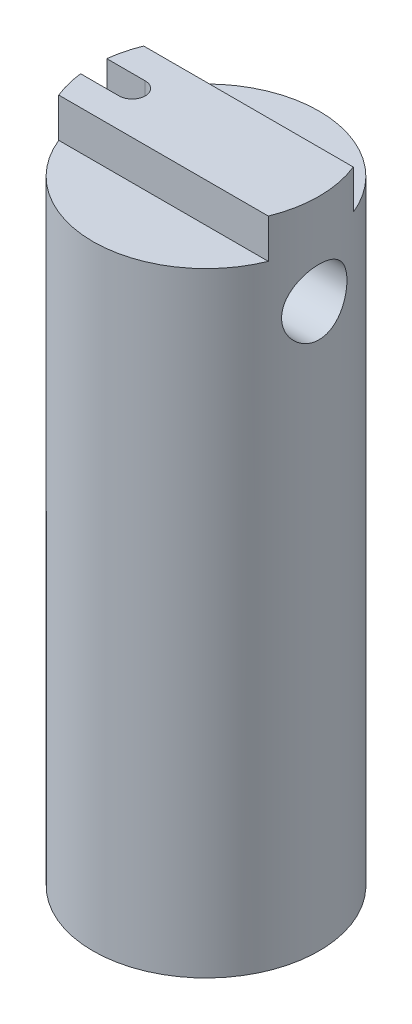
ISO-10303-21;
HEADER;
FILE_DESCRIPTION(('STEP AP214'),'2;1');
FILE_NAME('part.step','',(''),(''),'','','');
FILE_SCHEMA(('AUTOMOTIVE_DESIGN { 1 0 10303 214 1 1 1 1 }'));
ENDSEC;
DATA;
#1=APPLICATION_CONTEXT('core data for automotive mechanical design processes');
#2=APPLICATION_PROTOCOL_DEFINITION('international standard','automotive_design',2000,#1);
#3=PRODUCT_CONTEXT('',#1,'mechanical');
#4=PRODUCT('Part','Part','',(#3));
#5=PRODUCT_RELATED_PRODUCT_CATEGORY('part','',(#4));
#6=PRODUCT_DEFINITION_FORMATION('','',#4);
#7=PRODUCT_DEFINITION_CONTEXT('part definition',#1,'design');
#8=PRODUCT_DEFINITION('design','',#6,#7);
#9=PRODUCT_DEFINITION_SHAPE('','',#8);
#10=(LENGTH_UNIT() NAMED_UNIT(*) SI_UNIT(.MILLI.,.METRE.));
#11=(NAMED_UNIT(*) PLANE_ANGLE_UNIT() SI_UNIT($,.RADIAN.));
#12=(NAMED_UNIT(*) SI_UNIT($,.STERADIAN.) SOLID_ANGLE_UNIT());
#13=UNCERTAINTY_MEASURE_WITH_UNIT(LENGTH_MEASURE(1.E-05),#10,'distance_accuracy_value','');
#14=(GEOMETRIC_REPRESENTATION_CONTEXT(3) GLOBAL_UNCERTAINTY_ASSIGNED_CONTEXT((#13)) GLOBAL_UNIT_ASSIGNED_CONTEXT((#10,
#11,#12)) REPRESENTATION_CONTEXT('',''));
#15=CARTESIAN_POINT('',(0.,0.,0.));
#16=DIRECTION('',(0.,0.,1.));
#17=DIRECTION('',(1.,0.,0.));
#18=AXIS2_PLACEMENT_3D('',#15,#16,#17);
#19=CARTESIAN_POINT('',(0.,-50.,0.));
#20=DIRECTION('',(0.,1.,0.));
#21=DIRECTION('',(0.,0.,1.));
#22=AXIS2_PLACEMENT_3D('',#19,#20,#21);
#23=CYLINDRICAL_SURFACE('',#22,8.65000000000001);
#24=CARTESIAN_POINT('',(8.28085140550174,-7.,-2.49999999999999));
#25=CARTESIAN_POINT('',(8.28085322376039,-6.86275889358771,-2.49999769228479));
#26=CARTESIAN_POINT('',(8.28430054332778,-6.72549461628499,-2.48866045927901));
#27=CARTESIAN_POINT('',(8.2976670899937,-6.45496245214444,-2.44371720208671));
#28=CARTESIAN_POINT('',(8.30758884133336,-6.32169614523445,-2.41010249231336));
#29=CARTESIAN_POINT('',(8.33268872764418,-6.06311422261727,-2.32182760939016));
#30=CARTESIAN_POINT('',(8.34785858328595,-5.93778644946403,-2.26720056987894));
#31=CARTESIAN_POINT('',(8.38173444287658,-5.69804713837223,-2.13855897619452));
#32=CARTESIAN_POINT('',(8.40044089191065,-5.58363697716041,-2.06454198131571));
#33=CARTESIAN_POINT('',(8.43989824325808,-5.36562032598627,-1.89689487117158));
#34=CARTESIAN_POINT('',(8.46069027844958,-5.26238194617315,-1.80279562216665));
#35=CARTESIAN_POINT('',(8.50162347229231,-5.07290963685424,-1.59866174479604));
#36=CARTESIAN_POINT('',(8.52176455283785,-4.98667774160831,-1.48862521279191));
#37=CARTESIAN_POINT('',(8.55959091954456,-4.83208950058936,-1.25314418411789));
#38=CARTESIAN_POINT('',(8.57722206612258,-4.76410528932715,-1.12744593317654));
#39=CARTESIAN_POINT('',(8.60756615481593,-4.65037988823474,-0.865806137571206));
#40=CARTESIAN_POINT('',(8.62028007768423,-4.60463426239299,-0.729866642019158));
#41=CARTESIAN_POINT('',(8.63906623394997,-4.53789359716114,-0.455451452356293));
#42=CARTESIAN_POINT('',(8.64530657227224,-4.5162709443423,-0.317140114448814));
#43=CARTESIAN_POINT('',(8.65103299621578,-4.49640888690367,-0.0387215687059775));
#44=CARTESIAN_POINT('',(8.65052040187899,-4.49816491229442,0.101385282798723));
#45=CARTESIAN_POINT('',(8.6429190331002,-4.52458200293445,0.375026599869924));
#46=CARTESIAN_POINT('',(8.6360252374013,-4.54856397684487,0.508632884649997));
#47=CARTESIAN_POINT('',(8.61667065260533,-4.61764708793833,0.769836720116405));
#48=CARTESIAN_POINT('',(8.60420952141952,-4.6627495228908,0.897433901036584));
#49=CARTESIAN_POINT('',(8.57484418518508,-4.7732734448961,1.14465227980842));
#50=CARTESIAN_POINT('',(8.55789218916658,-4.83891495431073,1.26416920176256));
#51=CARTESIAN_POINT('',(8.52135310844036,-4.98848155042203,1.49071374952026));
#52=CARTESIAN_POINT('',(8.50176543559973,-5.07241072047892,1.5977385778176));
#53=CARTESIAN_POINT('',(8.46123095697068,-5.25972125834663,1.80031492214499));
#54=CARTESIAN_POINT('',(8.44026060223056,-5.36369254293566,1.89531696591399));
#55=CARTESIAN_POINT('',(8.39994547788299,-5.58630076609,2.066684950439));
#56=CARTESIAN_POINT('',(8.3806008467113,-5.70493895146947,2.14304930518591));
#57=CARTESIAN_POINT('',(8.34562064374236,-5.95487175612977,2.27549291299663));
#58=CARTESIAN_POINT('',(8.33001733288379,-6.08626363006372,2.33139777376546));
#59=CARTESIAN_POINT('',(8.3046741970681,-6.3571496169274,2.42013226280127));
#60=CARTESIAN_POINT('',(8.29493261974098,-6.49664129472688,2.45296878785813));
#61=CARTESIAN_POINT('',(8.28279676206013,-6.77456817162309,2.49363498431357));
#62=CARTESIAN_POINT('',(8.28015874382514,-6.91287140149247,2.50229461475222));
#63=CARTESIAN_POINT('',(8.2818570952544,-7.18895519418841,2.49666841228663));
#64=CARTESIAN_POINT('',(8.28619257120024,-7.32673582172305,2.4823855196813));
#65=CARTESIAN_POINT('',(8.30111144335729,-7.59449342913186,2.43201645868713));
#66=CARTESIAN_POINT('',(8.31154507352058,-7.72457781669547,2.39645245580023));
#67=CARTESIAN_POINT('',(8.33733248636691,-7.97692857106371,2.30512983258329));
#68=CARTESIAN_POINT('',(8.35268699053245,-8.09919378829191,2.2493682507939));
#69=CARTESIAN_POINT('',(8.3870680997782,-8.33584418852758,2.11762173240531));
#70=CARTESIAN_POINT('',(8.40617756772015,-8.44995277988932,2.04116211759291));
#71=CARTESIAN_POINT('',(8.4457318258527,-8.66402381235529,1.87076193412246));
#72=CARTESIAN_POINT('',(8.46617691167614,-8.76398310596633,1.77681748671075));
#73=CARTESIAN_POINT('',(8.50695656464454,-8.95048464614675,1.57023366032182));
#74=CARTESIAN_POINT('',(8.52726273302557,-9.03644167951082,1.45705911465026));
#75=CARTESIAN_POINT('',(8.56475831258217,-9.1881510131364,1.2174158958495));
#76=CARTESIAN_POINT('',(8.58194788525379,-9.25390436043724,1.09094791209778));
#77=CARTESIAN_POINT('',(8.61116483842541,-9.36270966992412,0.829176090527664));
#78=CARTESIAN_POINT('',(8.62323110853566,-9.40593324239973,0.693948139322728));
#79=CARTESIAN_POINT('',(8.64101371064214,-9.46891538769943,0.417740144326336));
#80=CARTESIAN_POINT('',(8.64673171743505,-9.48868014951411,0.276761627827327));
#81=CARTESIAN_POINT('',(8.65107930152753,-9.50374075806176,-0.00151823492443659));
#82=CARTESIAN_POINT('',(8.64995564337549,-9.49988839002659,-0.138770225457254));
#83=CARTESIAN_POINT('',(8.64131972256357,-9.4698403531093,-0.41058960183081));
#84=CARTESIAN_POINT('',(8.63380777832634,-9.4436457978682,-0.54515712113625));
#85=CARTESIAN_POINT('',(8.61330271008766,-9.37016979152791,-0.806575458170936));
#86=CARTESIAN_POINT('',(8.60036140915817,-9.32308747559144,-0.933486586325141));
#87=CARTESIAN_POINT('',(8.57034000082596,-9.20934971696781,-1.17767733386419));
#88=CARTESIAN_POINT('',(8.55325924315235,-9.14269119868902,-1.29495543610907));
#89=CARTESIAN_POINT('',(8.5161214057924,-8.98934945085336,-1.52040539398673));
#90=CARTESIAN_POINT('',(8.49598989406107,-8.90212123783287,-1.62819423311826));
#91=CARTESIAN_POINT('',(8.45527783091918,-8.71111518887002,-1.82789062235672));
#92=CARTESIAN_POINT('',(8.43469715566095,-8.60733273737311,-1.91979372836344));
#93=CARTESIAN_POINT('',(8.39476598761253,-8.38279055628811,-2.08759650932855));
#94=CARTESIAN_POINT('',(8.37546385378877,-8.26164741480997,-2.16299583453981));
#95=CARTESIAN_POINT('',(8.34101541303892,-8.00786333984392,-2.29226184120731));
#96=CARTESIAN_POINT('',(8.32586685481773,-7.87522868642315,-2.34614019458919));
#97=CARTESIAN_POINT('',(8.30314969949933,-7.61959099223756,-2.42521604453701));
#98=CARTESIAN_POINT('',(8.29486282049023,-7.49750372993507,-2.4531868369833));
#99=CARTESIAN_POINT('',(8.28371329696176,-7.25028372678931,-2.49057831939011));
#100=CARTESIAN_POINT('',(8.28084974741402,-7.12515149761131,-2.5000021044279));
#101=CARTESIAN_POINT('',(8.28085140550174,-7.,-2.49999999999999));
#102=B_SPLINE_CURVE_WITH_KNOTS('',3,(#24,#25,#26,#27,#28,#29,#30,#31,#32,#33,#34,#35,#36,#37,
#38,#39,#40,#41,#42,#43,#44,#45,#46,#47,#48,#49,#50,#51,#52,#53,#54,#55,#56,#57,#58,#59,#60,#61,
#62,#63,#64,#65,#66,#67,#68,#69,#70,#71,#72,#73,#74,#75,#76,#77,#78,#79,#80,#81,#82,#83,#84,#85,
#86,#87,#88,#89,#90,#91,#92,#93,#94,#95,#96,#97,#98,#99,#100,#101),.UNSPECIFIED.,.T.,.F.,(4,2,2,
2,2,2,2,2,2,2,2,2,2,2,2,2,2,2,2,2,2,2,2,2,2,2,2,2,2,2,2,2,2,2,2,2,2,2,4),(0.,0.411262171979639,
0.822684782074835,1.23346127574435,1.6442895006641,2.06604041547225,2.48784174818307,
2.9176846054889,3.34744168525811,3.76573611038611,4.18394876985462,4.58979026664504,
4.99565670407505,5.4060290563878,5.81649313275795,6.24168527722219,6.66691359160376,
7.0956863964371,7.52433095552636,7.93806836379586,8.35175275197718,8.75568057143647,
9.15966764058979,9.57384586871271,9.98811608594928,10.4167468573414,10.8453554115503,
11.2706496844102,11.6958317295967,12.1057714274345,12.5156906931192,12.9217832420427,
13.3279396257996,13.7463881494923,14.1649535471111,14.5948453531576,15.0245036892449,
15.3996002578841,15.7746342260562),.UNSPECIFIED.);
#103=CARTESIAN_POINT('',(8.28085140550174,-7.,-2.49999999999999));
#104=VERTEX_POINT('',#103);
#105=EDGE_CURVE('E13',#104,#104,#102,.T.);
#106=ORIENTED_EDGE('',*,*,#105,.F.);
#107=EDGE_LOOP('',(#106));
#108=FACE_BOUND('',#107,.T.);
#109=DIRECTION('',(0.,1.,0.));
#110=VECTOR('',#109,1.);
#111=CARTESIAN_POINT('',(-8.01623352953244,-50.,3.25));
#112=LINE('',#111,#110);
#113=CARTESIAN_POINT('',(-8.01623352953244,0.,3.25));
#114=VERTEX_POINT('',#113);
#115=CARTESIAN_POINT('',(-8.01623352953244,-3.,3.25));
#116=VERTEX_POINT('',#115);
#117=EDGE_CURVE('E167',#114,#116,#112,.F.);
#118=ORIENTED_EDGE('',*,*,#117,.F.);
#119=CARTESIAN_POINT('',(0.,0.,0.));
#120=DIRECTION('',(0.,1.,0.));
#121=DIRECTION('',(0.,0.,1.));
#122=AXIS2_PLACEMENT_3D('',#119,#120,#121);
#123=CIRCLE('',#122,8.65000000000001);
#124=CARTESIAN_POINT('',(-8.59200209497182,0.,1.));
#125=VERTEX_POINT('',#124);
#126=EDGE_CURVE('E216',#125,#114,#123,.T.);
#127=ORIENTED_EDGE('',*,*,#126,.F.);
#128=DIRECTION('',(0.,1.,0.));
#129=VECTOR('',#128,1.);
#130=CARTESIAN_POINT('',(-8.59200209497182,-50.,1.));
#131=LINE('',#130,#129);
#132=CARTESIAN_POINT('',(-8.59200209497182,-10.,1.));
#133=VERTEX_POINT('',#132);
#134=EDGE_CURVE('E185',#125,#133,#131,.F.);
#135=ORIENTED_EDGE('',*,*,#134,.T.);
#136=CARTESIAN_POINT('',(0.,-10.,0.));
#137=DIRECTION('',(0.,-1.,0.));
#138=DIRECTION('',(0.,0.,-1.));
#139=AXIS2_PLACEMENT_3D('',#136,#137,#138);
#140=CIRCLE('',#139,8.65000000000001);
#141=CARTESIAN_POINT('',(-8.11310667993464,-10.,3.));
#142=VERTEX_POINT('',#141);
#143=EDGE_CURVE('E222',#133,#142,#140,.F.);
#144=ORIENTED_EDGE('',*,*,#143,.T.);
#145=DIRECTION('',(0.,1.,0.));
#146=VECTOR('',#145,1.);
#147=CARTESIAN_POINT('',(-8.11310667993464,-50.,3.));
#148=LINE('',#147,#146);
#149=CARTESIAN_POINT('',(-8.11310667993464,-50.,3.));
#150=VERTEX_POINT('',#149);
#151=EDGE_CURVE('E204',#150,#142,#148,.T.);
#152=ORIENTED_EDGE('',*,*,#151,.F.);
#153=CARTESIAN_POINT('',(0.,-50.,0.));
#154=DIRECTION('',(0.,1.,0.));
#155=DIRECTION('',(0.,0.,1.));
#156=AXIS2_PLACEMENT_3D('',#153,#154,#155);
#157=CIRCLE('',#156,8.65000000000001);
#158=CARTESIAN_POINT('',(-8.11310667993464,-50.,-3.));
#159=VERTEX_POINT('',#158);
#160=EDGE_CURVE('E212',#150,#159,#157,.T.);
#161=ORIENTED_EDGE('',*,*,#160,.T.);
#162=DIRECTION('',(0.,1.,0.));
#163=VECTOR('',#162,1.);
#164=CARTESIAN_POINT('',(-8.11310667993464,-50.,-3.));
#165=LINE('',#164,#163);
#166=CARTESIAN_POINT('',(-8.11310667993464,-10.,-3.));
#167=VERTEX_POINT('',#166);
#168=EDGE_CURVE('E209',#167,#159,#165,.F.);
#169=ORIENTED_EDGE('',*,*,#168,.F.);
#170=CARTESIAN_POINT('',(-8.59200209497182,-10.,-1.));
#171=VERTEX_POINT('',#170);
#172=EDGE_CURVE('E223',#167,#171,#140,.F.);
#173=ORIENTED_EDGE('',*,*,#172,.T.);
#174=DIRECTION('',(0.,1.,0.));
#175=VECTOR('',#174,1.);
#176=CARTESIAN_POINT('',(-8.59200209497182,-50.,-1.));
#177=LINE('',#176,#175);
#178=CARTESIAN_POINT('',(-8.59200209497182,0.,-1.));
#179=VERTEX_POINT('',#178);
#180=EDGE_CURVE('E182',#171,#179,#177,.T.);
#181=ORIENTED_EDGE('',*,*,#180,.T.);
#182=CARTESIAN_POINT('',(-8.01623352953244,0.,-3.25));
#183=VERTEX_POINT('',#182);
#184=EDGE_CURVE('E211',#183,#179,#123,.T.);
#185=ORIENTED_EDGE('',*,*,#184,.F.);
#186=DIRECTION('',(0.,1.,0.));
#187=VECTOR('',#186,1.);
#188=CARTESIAN_POINT('',(-8.0162335295323,-50.,-3.25000000000035));
#189=LINE('',#188,#187);
#190=CARTESIAN_POINT('',(-8.0162335295323,-3.,-3.25000000000002));
#191=VERTEX_POINT('',#190);
#192=EDGE_CURVE('E69',#191,#183,#189,.T.);
#193=ORIENTED_EDGE('',*,*,#192,.F.);
#194=CARTESIAN_POINT('',(0.,-3.,0.));
#195=DIRECTION('',(0.,-1.,0.));
#196=DIRECTION('',(0.,0.,-1.));
#197=AXIS2_PLACEMENT_3D('',#194,#195,#196);
#198=CIRCLE('',#197,8.65000000000001);
#199=CARTESIAN_POINT('',(8.0162335295323,-3.,-3.25000000000002));
#200=VERTEX_POINT('',#199);
#201=EDGE_CURVE('E239',#200,#191,#198,.F.);
#202=ORIENTED_EDGE('',*,*,#201,.F.);
#203=DIRECTION('',(0.,1.,0.));
#204=VECTOR('',#203,1.);
#205=CARTESIAN_POINT('',(8.0162335295323,-50.,-3.25000000000035));
#206=LINE('',#205,#204);
#207=CARTESIAN_POINT('',(8.01623352953244,0.,-3.25));
#208=VERTEX_POINT('',#207);
#209=EDGE_CURVE('E164',#208,#200,#206,.F.);
#210=ORIENTED_EDGE('',*,*,#209,.F.);
#211=CARTESIAN_POINT('',(8.01623352953244,0.,3.25));
#212=VERTEX_POINT('',#211);
#213=EDGE_CURVE('E219',#212,#208,#123,.T.);
#214=ORIENTED_EDGE('',*,*,#213,.F.);
#215=DIRECTION('',(0.,1.,0.));
#216=VECTOR('',#215,1.);
#217=CARTESIAN_POINT('',(8.01623352953244,-50.,3.25));
#218=LINE('',#217,#216);
#219=CARTESIAN_POINT('',(8.01623352953244,-3.,3.25));
#220=VERTEX_POINT('',#219);
#221=EDGE_CURVE('E77',#220,#212,#218,.T.);
#222=ORIENTED_EDGE('',*,*,#221,.F.);
#223=CARTESIAN_POINT('',(0.,-3.,0.));
#224=DIRECTION('',(0.,-1.,0.));
#225=DIRECTION('',(0.,0.,-1.));
#226=AXIS2_PLACEMENT_3D('',#223,#224,#225);
#227=CIRCLE('',#226,8.65000000000001);
#228=EDGE_CURVE('E62',#116,#220,#227,.F.);
#229=ORIENTED_EDGE('',*,*,#228,.F.);
#230=EDGE_LOOP('',(#118,#127,#135,#144,#152,#161,#169,#173,#181,#185,#193,#202,#210,#214,#222,#229));
#231=FACE_BOUND('',#230,.T.);
#232=ADVANCED_FACE('F50',(#108,#231),#23,.T.);
#233=CARTESIAN_POINT('',(0.,0.,0.));
#234=DIRECTION('',(0.,1.,0.));
#235=DIRECTION('',(0.,0.,1.));
#236=AXIS2_PLACEMENT_3D('',#233,#234,#235);
#237=PLANE('',#236);
#238=DIRECTION('',(-1.,0.,0.));
#239=VECTOR('',#238,1.);
#240=CARTESIAN_POINT('',(0.,0.,3.25));
#241=LINE('',#240,#239);
#242=EDGE_CURVE('E237',#212,#114,#241,.T.);
#243=ORIENTED_EDGE('',*,*,#242,.F.);
#244=ORIENTED_EDGE('',*,*,#213,.T.);
#245=DIRECTION('',(1.,0.,0.));
#246=VECTOR('',#245,1.);
#247=CARTESIAN_POINT('',(0.,0.,-3.25));
#248=LINE('',#247,#246);
#249=EDGE_CURVE('E235',#183,#208,#248,.T.);
#250=ORIENTED_EDGE('',*,*,#249,.F.);
#251=ORIENTED_EDGE('',*,*,#184,.T.);
#252=DIRECTION('',(1.,0.,0.));
#253=VECTOR('',#252,1.);
#254=CARTESIAN_POINT('',(-5.65,0.,-1.));
#255=LINE('',#254,#253);
#256=CARTESIAN_POINT('',(-5.65,0.,-1.));
#257=VERTEX_POINT('',#256);
#258=EDGE_CURVE('E175',#179,#257,#255,.T.);
#259=ORIENTED_EDGE('',*,*,#258,.T.);
#260=CARTESIAN_POINT('',(-5.65,0.,0.));
#261=DIRECTION('',(0.,-1.,0.));
#262=DIRECTION('',(0.,0.,-1.));
#263=AXIS2_PLACEMENT_3D('',#260,#261,#262);
#264=CIRCLE('',#263,1.);
#265=CARTESIAN_POINT('',(-5.65,0.,1.));
#266=VERTEX_POINT('',#265);
#267=EDGE_CURVE('E169',#257,#266,#264,.T.);
#268=ORIENTED_EDGE('',*,*,#267,.T.);
#269=DIRECTION('',(-1.,0.,0.));
#270=VECTOR('',#269,1.);
#271=CARTESIAN_POINT('',(-5.65,0.,1.));
#272=LINE('',#271,#270);
#273=EDGE_CURVE('E172',#266,#125,#272,.T.);
#274=ORIENTED_EDGE('',*,*,#273,.T.);
#275=ORIENTED_EDGE('',*,*,#126,.T.);
#276=EDGE_LOOP('',(#243,#244,#250,#251,#259,#268,#274,#275));
#277=FACE_BOUND('',#276,.T.);
#278=ADVANCED_FACE('F253',(#277),#237,.T.);
#279=CARTESIAN_POINT('',(-5.65,-10.,0.));
#280=DIRECTION('',(0.,-1.,0.));
#281=DIRECTION('',(0.,0.,-1.));
#282=AXIS2_PLACEMENT_3D('',#279,#280,#281);
#283=PLANE('',#282);
#284=ORIENTED_EDGE('',*,*,#143,.F.);
#285=DIRECTION('',(1.,0.,0.));
#286=VECTOR('',#285,1.);
#287=CARTESIAN_POINT('',(-5.65,-10.,1.));
#288=LINE('',#287,#286);
#289=CARTESIAN_POINT('',(-5.65,-10.,1.));
#290=VERTEX_POINT('',#289);
#291=EDGE_CURVE('E232',#133,#290,#288,.T.);
#292=ORIENTED_EDGE('',*,*,#291,.T.);
#293=CARTESIAN_POINT('',(-5.65,-10.,0.));
#294=DIRECTION('',(0.,-1.,0.));
#295=DIRECTION('',(0.,0.,-1.));
#296=AXIS2_PLACEMENT_3D('',#293,#294,#295);
#297=CIRCLE('',#296,1.);
#298=CARTESIAN_POINT('',(-5.65,-10.,-1.));
#299=VERTEX_POINT('',#298);
#300=EDGE_CURVE('E229',#290,#299,#297,.F.);
#301=ORIENTED_EDGE('',*,*,#300,.T.);
#302=DIRECTION('',(-1.,0.,0.));
#303=VECTOR('',#302,1.);
#304=CARTESIAN_POINT('',(-5.65,-10.,-1.));
#305=LINE('',#304,#303);
#306=EDGE_CURVE('E226',#299,#171,#305,.T.);
#307=ORIENTED_EDGE('',*,*,#306,.T.);
#308=ORIENTED_EDGE('',*,*,#172,.F.);
#309=DIRECTION('',(1.,0.,0.));
#310=VECTOR('',#309,1.);
#311=CARTESIAN_POINT('',(-5.65,-10.,-3.));
#312=LINE('',#311,#310);
#313=CARTESIAN_POINT('',(-5.65,-10.,-3.));
#314=VERTEX_POINT('',#313);
#315=EDGE_CURVE('E196',#167,#314,#312,.T.);
#316=ORIENTED_EDGE('',*,*,#315,.T.);
#317=CARTESIAN_POINT('',(-5.65,-10.,0.));
#318=DIRECTION('',(0.,-1.,0.));
#319=DIRECTION('',(0.,0.,-1.));
#320=AXIS2_PLACEMENT_3D('',#317,#318,#319);
#321=CIRCLE('',#320,3.);
#322=CARTESIAN_POINT('',(-5.65000000000001,-10.,3.));
#323=VERTEX_POINT('',#322);
#324=EDGE_CURVE('E189',#314,#323,#321,.T.);
#325=ORIENTED_EDGE('',*,*,#324,.T.);
#326=DIRECTION('',(-1.,0.,0.));
#327=VECTOR('',#326,1.);
#328=CARTESIAN_POINT('',(-5.65000000000001,-10.,3.));
#329=LINE('',#328,#327);
#330=EDGE_CURVE('E192',#323,#142,#329,.T.);
#331=ORIENTED_EDGE('',*,*,#330,.T.);
#332=EDGE_LOOP('',(#284,#292,#301,#307,#308,#316,#325,#331));
#333=FACE_BOUND('',#332,.T.);
#334=ADVANCED_FACE('F262',(#333),#283,.T.);
#335=CARTESIAN_POINT('',(0.,-50.,0.));
#336=DIRECTION('',(0.,1.,0.));
#337=DIRECTION('',(0.,0.,1.));
#338=AXIS2_PLACEMENT_3D('',#335,#336,#337);
#339=PLANE('',#338);
#340=CARTESIAN_POINT('',(-5.65,-50.,0.));
#341=DIRECTION('',(0.,-1.,0.));
#342=DIRECTION('',(0.,0.,-1.));
#343=AXIS2_PLACEMENT_3D('',#340,#341,#342);
#344=CIRCLE('',#343,3.);
#345=CARTESIAN_POINT('',(-5.65,-50.,-3.));
#346=VERTEX_POINT('',#345);
#347=CARTESIAN_POINT('',(-5.65000000000001,-50.,3.));
#348=VERTEX_POINT('',#347);
#349=EDGE_CURVE('E188',#346,#348,#344,.T.);
#350=ORIENTED_EDGE('',*,*,#349,.F.);
#351=DIRECTION('',(-1.,0.,0.));
#352=VECTOR('',#351,1.);
#353=CARTESIAN_POINT('',(0.,-50.,-3.));
#354=LINE('',#353,#352);
#355=EDGE_CURVE('E215',#346,#159,#354,.T.);
#356=ORIENTED_EDGE('',*,*,#355,.T.);
#357=ORIENTED_EDGE('',*,*,#160,.F.);
#358=DIRECTION('',(-1.,0.,0.));
#359=VECTOR('',#358,1.);
#360=CARTESIAN_POINT('',(-5.65000000000001,-50.,3.));
#361=LINE('',#360,#359);
#362=EDGE_CURVE('E193',#348,#150,#361,.T.);
#363=ORIENTED_EDGE('',*,*,#362,.F.);
#364=EDGE_LOOP('',(#350,#356,#357,#363));
#365=FACE_BOUND('',#364,.T.);
#366=ADVANCED_FACE('F277',(#365),#339,.F.);
#367=CARTESIAN_POINT('',(-5.65,-10.,0.));
#368=DIRECTION('',(0.,-1.,0.));
#369=DIRECTION('',(0.,0.,-1.));
#370=AXIS2_PLACEMENT_3D('',#367,#368,#369);
#371=CYLINDRICAL_SURFACE('',#370,3.);
#372=ORIENTED_EDGE('',*,*,#349,.T.);
#373=DIRECTION('',(0.,-1.,0.));
#374=VECTOR('',#373,1.);
#375=CARTESIAN_POINT('',(-5.65000000000001,-10.,3.));
#376=LINE('',#375,#374);
#377=EDGE_CURVE('E198',#323,#348,#376,.T.);
#378=ORIENTED_EDGE('',*,*,#377,.F.);
#379=ORIENTED_EDGE('',*,*,#324,.F.);
#380=DIRECTION('',(0.,-1.,0.));
#381=VECTOR('',#380,1.);
#382=CARTESIAN_POINT('',(-5.65,-10.,-3.));
#383=LINE('',#382,#381);
#384=EDGE_CURVE('E201',#314,#346,#383,.T.);
#385=ORIENTED_EDGE('',*,*,#384,.T.);
#386=EDGE_LOOP('',(#372,#378,#379,#385));
#387=FACE_BOUND('',#386,.T.);
#388=ADVANCED_FACE('F269',(#387),#371,.F.);
#389=CARTESIAN_POINT('',(-5.65,-10.,-3.));
#390=DIRECTION('',(0.,0.,-1.));
#391=DIRECTION('',(-1.,0.,0.));
#392=AXIS2_PLACEMENT_3D('',#389,#390,#391);
#393=PLANE('',#392);
#394=ORIENTED_EDGE('',*,*,#168,.T.);
#395=ORIENTED_EDGE('',*,*,#355,.F.);
#396=ORIENTED_EDGE('',*,*,#384,.F.);
#397=ORIENTED_EDGE('',*,*,#315,.F.);
#398=EDGE_LOOP('',(#394,#395,#396,#397));
#399=FACE_BOUND('',#398,.T.);
#400=ADVANCED_FACE('F265',(#399),#393,.F.);
#401=CARTESIAN_POINT('',(-5.65000000000001,-10.,3.));
#402=DIRECTION('',(0.,0.,1.));
#403=DIRECTION('',(1.,0.,0.));
#404=AXIS2_PLACEMENT_3D('',#401,#402,#403);
#405=PLANE('',#404);
#406=ORIENTED_EDGE('',*,*,#151,.T.);
#407=ORIENTED_EDGE('',*,*,#330,.F.);
#408=ORIENTED_EDGE('',*,*,#377,.T.);
#409=ORIENTED_EDGE('',*,*,#362,.T.);
#410=EDGE_LOOP('',(#406,#407,#408,#409));
#411=FACE_BOUND('',#410,.T.);
#412=ADVANCED_FACE('F272',(#411),#405,.F.);
#413=CARTESIAN_POINT('',(-5.65,-50.,0.));
#414=DIRECTION('',(0.,1.,0.));
#415=DIRECTION('',(0.,0.,1.));
#416=AXIS2_PLACEMENT_3D('',#413,#414,#415);
#417=CYLINDRICAL_SURFACE('',#416,1.);
#418=DIRECTION('',(0.,1.,0.));
#419=VECTOR('',#418,1.);
#420=CARTESIAN_POINT('',(-5.65,-50.,1.));
#421=LINE('',#420,#419);
#422=EDGE_CURVE('E180',#290,#266,#421,.T.);
#423=ORIENTED_EDGE('',*,*,#422,.T.);
#424=ORIENTED_EDGE('',*,*,#267,.F.);
#425=DIRECTION('',(0.,1.,0.));
#426=VECTOR('',#425,1.);
#427=CARTESIAN_POINT('',(-5.65,-50.,-1.));
#428=LINE('',#427,#426);
#429=EDGE_CURVE('E178',#299,#257,#428,.T.);
#430=ORIENTED_EDGE('',*,*,#429,.F.);
#431=ORIENTED_EDGE('',*,*,#300,.F.);
#432=EDGE_LOOP('',(#423,#424,#430,#431));
#433=FACE_BOUND('',#432,.T.);
#434=ADVANCED_FACE('F314',(#433),#417,.F.);
#435=CARTESIAN_POINT('',(-5.65,-50.,1.));
#436=DIRECTION('',(0.,0.,-1.));
#437=DIRECTION('',(-1.,0.,0.));
#438=AXIS2_PLACEMENT_3D('',#435,#436,#437);
#439=PLANE('',#438);
#440=ORIENTED_EDGE('',*,*,#273,.F.);
#441=ORIENTED_EDGE('',*,*,#422,.F.);
#442=ORIENTED_EDGE('',*,*,#291,.F.);
#443=ORIENTED_EDGE('',*,*,#134,.F.);
#444=EDGE_LOOP('',(#440,#441,#442,#443));
#445=FACE_BOUND('',#444,.T.);
#446=ADVANCED_FACE('F311',(#445),#439,.T.);
#447=CARTESIAN_POINT('',(-5.65,-50.,-1.));
#448=DIRECTION('',(0.,0.,1.));
#449=DIRECTION('',(1.,0.,0.));
#450=AXIS2_PLACEMENT_3D('',#447,#448,#449);
#451=PLANE('',#450);
#452=ORIENTED_EDGE('',*,*,#306,.F.);
#453=ORIENTED_EDGE('',*,*,#429,.T.);
#454=ORIENTED_EDGE('',*,*,#258,.F.);
#455=ORIENTED_EDGE('',*,*,#180,.F.);
#456=EDGE_LOOP('',(#452,#453,#454,#455));
#457=FACE_BOUND('',#456,.T.);
#458=ADVANCED_FACE('F255',(#457),#451,.T.);
#459=CARTESIAN_POINT('',(-8.59200209497182,-3.,-3.25000000000002));
#460=DIRECTION('',(0.,-1.,0.));
#461=DIRECTION('',(0.,0.,-1.));
#462=AXIS2_PLACEMENT_3D('',#459,#460,#461);
#463=PLANE('',#462);
#464=ORIENTED_EDGE('',*,*,#201,.T.);
#465=DIRECTION('',(1.,0.,0.));
#466=VECTOR('',#465,1.);
#467=CARTESIAN_POINT('',(-8.59200209497182,-3.,-3.25000000000002));
#468=LINE('',#467,#466);
#469=EDGE_CURVE('E156',#191,#200,#468,.T.);
#470=ORIENTED_EDGE('',*,*,#469,.T.);
#471=EDGE_LOOP('',(#464,#470));
#472=FACE_BOUND('',#471,.T.);
#473=ADVANCED_FACE('F305',(#472),#463,.F.);
#474=CARTESIAN_POINT('',(-8.59200209497182,-3.,-3.25000000000002));
#475=DIRECTION('',(0.,0.,1.));
#476=DIRECTION('',(0.,-1.,0.));
#477=AXIS2_PLACEMENT_3D('',#474,#475,#476);
#478=PLANE('',#477);
#479=ORIENTED_EDGE('',*,*,#209,.T.);
#480=ORIENTED_EDGE('',*,*,#469,.F.);
#481=ORIENTED_EDGE('',*,*,#192,.T.);
#482=ORIENTED_EDGE('',*,*,#249,.T.);
#483=EDGE_LOOP('',(#479,#480,#481,#482));
#484=FACE_BOUND('',#483,.T.);
#485=ADVANCED_FACE('F302',(#484),#478,.F.);
#486=CARTESIAN_POINT('',(-8.59200209497182,-3.,3.25));
#487=DIRECTION('',(0.,0.,-1.));
#488=DIRECTION('',(-1.,0.,0.));
#489=AXIS2_PLACEMENT_3D('',#486,#487,#488);
#490=PLANE('',#489);
#491=ORIENTED_EDGE('',*,*,#117,.T.);
#492=DIRECTION('',(1.,0.,0.));
#493=VECTOR('',#492,1.);
#494=CARTESIAN_POINT('',(-8.59200209497182,-3.,3.25));
#495=LINE('',#494,#493);
#496=EDGE_CURVE('E159',#116,#220,#495,.T.);
#497=ORIENTED_EDGE('',*,*,#496,.T.);
#498=ORIENTED_EDGE('',*,*,#221,.T.);
#499=ORIENTED_EDGE('',*,*,#242,.T.);
#500=EDGE_LOOP('',(#491,#497,#498,#499));
#501=FACE_BOUND('',#500,.T.);
#502=ADVANCED_FACE('F245',(#501),#490,.F.);
#503=CARTESIAN_POINT('',(-8.59200209497182,-3.,3.25));
#504=DIRECTION('',(0.,-1.,0.));
#505=DIRECTION('',(0.,0.,-1.));
#506=AXIS2_PLACEMENT_3D('',#503,#504,#505);
#507=PLANE('',#506);
#508=ORIENTED_EDGE('',*,*,#228,.T.);
#509=ORIENTED_EDGE('',*,*,#496,.F.);
#510=EDGE_LOOP('',(#508,#509));
#511=FACE_BOUND('',#510,.T.);
#512=ADVANCED_FACE('F150',(#511),#507,.F.);
#513=CARTESIAN_POINT('',(3.65,-7.,0.));
#514=DIRECTION('',(1.,0.,0.));
#515=DIRECTION('',(0.,0.,-1.));
#516=AXIS2_PLACEMENT_3D('',#513,#514,#515);
#517=CONICAL_SURFACE('',#516,2.5,1.02974425867665);
#518=CARTESIAN_POINT('',(2.1478484524311,-7.,0.));
#519=VERTEX_POINT('',#518);
#520=VERTEX_LOOP('',#519);
#521=FACE_BOUND('',#520,.T.);
#522=CARTESIAN_POINT('',(3.65,-7.,0.));
#523=DIRECTION('',(1.,0.,0.));
#524=DIRECTION('',(0.,0.,-1.));
#525=AXIS2_PLACEMENT_3D('',#522,#523,#524);
#526=CIRCLE('',#525,2.5);
#527=CARTESIAN_POINT('',(3.65,-7.,-2.5));
#528=VERTEX_POINT('',#527);
#529=EDGE_CURVE('E154',#528,#528,#526,.T.);
#530=ORIENTED_EDGE('',*,*,#529,.T.);
#531=EDGE_LOOP('',(#530));
#532=FACE_BOUND('',#531,.T.);
#533=ADVANCED_FACE('F146',(#521,#532),#517,.F.);
#534=CARTESIAN_POINT('',(8.65000000000001,-7.,0.));
#535=DIRECTION('',(1.,0.,0.));
#536=DIRECTION('',(0.,0.,-1.));
#537=AXIS2_PLACEMENT_3D('',#534,#535,#536);
#538=CYLINDRICAL_SURFACE('',#537,2.49999999999999);
#539=ORIENTED_EDGE('',*,*,#105,.T.);
#540=EDGE_LOOP('',(#539));
#541=FACE_BOUND('',#540,.T.);
#542=ORIENTED_EDGE('',*,*,#529,.F.);
#543=EDGE_LOOP('',(#542));
#544=FACE_BOUND('',#543,.T.);
#545=ADVANCED_FACE('F149',(#541,#544),#538,.F.);
#546=CLOSED_SHELL('',(#232,#278,#334,#366,#388,#400,#412,#434,#446,#458,#473,#485,#502,#512,
#533,#545));
#547=MANIFOLD_SOLID_BREP('B2',#546);
#548=ADVANCED_BREP_SHAPE_REPRESENTATION('',(#18,#547),#14);
#549=SHAPE_DEFINITION_REPRESENTATION(#9,#548);
ENDSEC;
END-ISO-10303-21;
